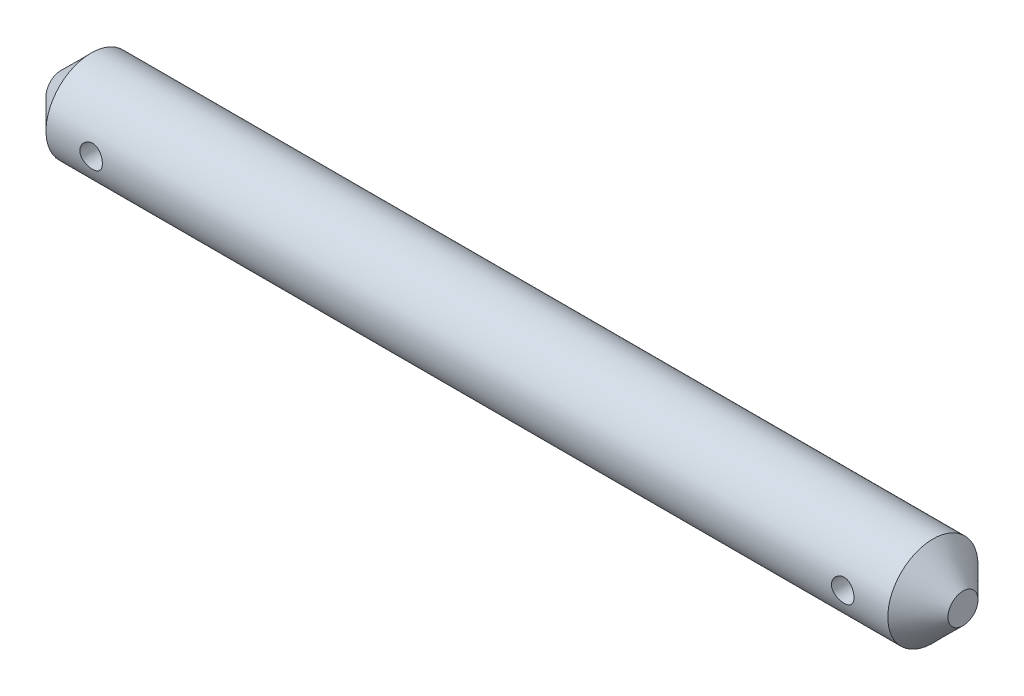
ISO-10303-21;
HEADER;
FILE_DESCRIPTION(('STEP AP214'),'2;1');
FILE_NAME('part.step','',(''),(''),'','','');
FILE_SCHEMA(('AUTOMOTIVE_DESIGN { 1 0 10303 214 1 1 1 1 }'));
ENDSEC;
DATA;
#1=APPLICATION_CONTEXT('core data for automotive mechanical design processes');
#2=APPLICATION_PROTOCOL_DEFINITION('international standard','automotive_design',2000,#1);
#3=PRODUCT_CONTEXT('',#1,'mechanical');
#4=PRODUCT('Part','Part','',(#3));
#5=PRODUCT_RELATED_PRODUCT_CATEGORY('part','',(#4));
#6=PRODUCT_DEFINITION_FORMATION('','',#4);
#7=PRODUCT_DEFINITION_CONTEXT('part definition',#1,'design');
#8=PRODUCT_DEFINITION('design','',#6,#7);
#9=PRODUCT_DEFINITION_SHAPE('','',#8);
#10=(LENGTH_UNIT() NAMED_UNIT(*) SI_UNIT(.MILLI.,.METRE.));
#11=(NAMED_UNIT(*) PLANE_ANGLE_UNIT() SI_UNIT($,.RADIAN.));
#12=(NAMED_UNIT(*) SI_UNIT($,.STERADIAN.) SOLID_ANGLE_UNIT());
#13=UNCERTAINTY_MEASURE_WITH_UNIT(LENGTH_MEASURE(1.E-05),#10,'distance_accuracy_value','');
#14=(GEOMETRIC_REPRESENTATION_CONTEXT(3) GLOBAL_UNCERTAINTY_ASSIGNED_CONTEXT((#13)) GLOBAL_UNIT_ASSIGNED_CONTEXT((#10,
#11,#12)) REPRESENTATION_CONTEXT('',''));
#15=CARTESIAN_POINT('',(0.,0.,0.));
#16=DIRECTION('',(0.,0.,1.));
#17=DIRECTION('',(1.,0.,0.));
#18=AXIS2_PLACEMENT_3D('',#15,#16,#17);
#19=CARTESIAN_POINT('',(60.,0.,0.));
#20=DIRECTION('',(-1.,0.,0.));
#21=DIRECTION('',(0.,0.,1.));
#22=AXIS2_PLACEMENT_3D('',#19,#20,#21);
#23=CYLINDRICAL_SURFACE('',#22,3.);
#24=CARTESIAN_POINT('',(5.75,0.,-3.));
#25=CARTESIAN_POINT('',(5.74999883713092,0.0414380443348655,-2.99999929934006));
#26=CARTESIAN_POINT('',(5.74655422461311,0.0828890789153816,-2.99913289065914));
#27=CARTESIAN_POINT('',(5.7328874243465,0.164603161885266,-2.99576056914946));
#28=CARTESIAN_POINT('',(5.72266139523107,0.204865523435369,-2.99325372709984));
#29=CARTESIAN_POINT('',(5.69578037326895,0.283010436091288,-2.9868781316602));
#30=CARTESIAN_POINT('',(5.67913310064236,0.320895781715001,-2.98301101421043));
#31=CARTESIAN_POINT('',(5.63990930497758,0.393336065952213,-2.97432671903796));
#32=CARTESIAN_POINT('',(5.61733258194053,0.427890892174379,-2.96950950927025));
#33=CARTESIAN_POINT('',(5.56639960517289,0.493400963650459,-2.95933706795901));
#34=CARTESIAN_POINT('',(5.53794421252041,0.524277845030535,-2.95397353574266));
#35=CARTESIAN_POINT('',(5.47627389754554,0.580874463601651,-2.94336810058765));
#36=CARTESIAN_POINT('',(5.44305843852675,0.606593618474567,-2.93812621144174));
#37=CARTESIAN_POINT('',(5.37220238663128,0.652513271399515,-2.92827387849855));
#38=CARTESIAN_POINT('',(5.3345033845948,0.672626107962678,-2.92367397235303));
#39=CARTESIAN_POINT('',(5.25612579417082,0.706198454275263,-2.91574747406112));
#40=CARTESIAN_POINT('',(5.21544768333712,0.719659027719666,-2.91242067836394));
#41=CARTESIAN_POINT('',(5.13312825089876,0.739277418402144,-2.90750238358775));
#42=CARTESIAN_POINT('',(5.0915225519751,0.745576134166668,-2.90587745537713));
#43=CARTESIAN_POINT('',(5.00781571549301,0.751130887533925,-2.9044468126887));
#44=CARTESIAN_POINT('',(4.9657146596507,0.750388070908988,-2.90464080224322));
#45=CARTESIAN_POINT('',(4.88329209612776,0.74199326231964,-2.90679602748309));
#46=CARTESIAN_POINT('',(4.84295218926745,0.734509170095259,-2.9087143150094));
#47=CARTESIAN_POINT('',(4.76411947454435,0.713112093451553,-2.91403354838242));
#48=CARTESIAN_POINT('',(4.72562679848551,0.699198651034711,-2.91743459985348));
#49=CARTESIAN_POINT('',(4.65113099187397,0.665194738968577,-2.92537556952093));
#50=CARTESIAN_POINT('',(4.61515691410522,0.645043333616455,-2.9299266373471));
#51=CARTESIAN_POINT('',(4.54704064512158,0.599178138007476,-2.93964855423193));
#52=CARTESIAN_POINT('',(4.51489912596637,0.573463374404419,-2.94481951167368));
#53=CARTESIAN_POINT('',(4.4543981921528,0.516331712340608,-2.9553794026989));
#54=CARTESIAN_POINT('',(4.42617275496932,0.484773129082929,-2.96077034738986));
#55=CARTESIAN_POINT('',(4.37538937876805,0.417305958751849,-2.97102982789393));
#56=CARTESIAN_POINT('',(4.35283161286822,0.381397238853971,-2.97589834774708));
#57=CARTESIAN_POINT('',(4.31397470688781,0.306057944340695,-2.98458866047091));
#58=CARTESIAN_POINT('',(4.29769732987279,0.266615696604311,-2.98840680063863));
#59=CARTESIAN_POINT('',(4.27204134714521,0.185438004071441,-2.99453958495709));
#60=CARTESIAN_POINT('',(4.26266142179093,0.143702999575242,-2.9968545166964));
#61=CARTESIAN_POINT('',(4.25127121722058,0.0602699851950132,-2.99967749635687));
#62=CARTESIAN_POINT('',(4.24907848696235,0.0185983599941046,-3.00023026754139));
#63=CARTESIAN_POINT('',(4.25162450102774,-0.0645164374007543,-2.99959402407225));
#64=CARTESIAN_POINT('',(4.25636262139957,-0.105959629822298,-2.99840516620923));
#65=CARTESIAN_POINT('',(4.27248545419569,-0.186807134388246,-2.99444790563678));
#66=CARTESIAN_POINT('',(4.28377063173849,-0.226232559484377,-2.99170317092906));
#67=CARTESIAN_POINT('',(4.31255354201422,-0.302628646226256,-2.98494353317067));
#68=CARTESIAN_POINT('',(4.33005190215659,-0.339599059516317,-2.98092850184946));
#69=CARTESIAN_POINT('',(4.37111806443736,-0.410761567214923,-2.97196653963155));
#70=CARTESIAN_POINT('',(4.39478805619838,-0.444892720917915,-2.96700433683466));
#71=CARTESIAN_POINT('',(4.44739495439849,-0.508763306821623,-2.9567225459371));
#72=CARTESIAN_POINT('',(4.47633276980845,-0.538501979486504,-2.95140289625852));
#73=CARTESIAN_POINT('',(4.53950098042223,-0.593495284036365,-2.94084478480386));
#74=CARTESIAN_POINT('',(4.57384385150121,-0.618621933811015,-2.9356115209364));
#75=CARTESIAN_POINT('',(4.64636631723286,-0.662755379506348,-2.92596439188619));
#76=CARTESIAN_POINT('',(4.68454574147988,-0.681762447078968,-2.92155049033513));
#77=CARTESIAN_POINT('',(4.76345286120654,-0.712975710304645,-2.91409047367332));
#78=CARTESIAN_POINT('',(4.804163814172,-0.725222198327032,-2.91103627645953));
#79=CARTESIAN_POINT('',(4.88715481894455,-0.742672829976889,-2.90663372045092));
#80=CARTESIAN_POINT('',(4.92943452551625,-0.747878513739328,-2.90528498859968));
#81=CARTESIAN_POINT('',(5.0130605119276,-0.751019295166997,-2.90447450601978));
#82=CARTESIAN_POINT('',(5.05439871756237,-0.749158948890058,-2.90495966364132));
#83=CARTESIAN_POINT('',(5.13615194433399,-0.738688639156433,-2.90763954503921));
#84=CARTESIAN_POINT('',(5.17656698400683,-0.730078811343384,-2.90983423445928));
#85=CARTESIAN_POINT('',(5.2551042295327,-0.706465659721396,-2.91565630341361));
#86=CARTESIAN_POINT('',(5.2932386526201,-0.691500702340187,-2.91927507618155));
#87=CARTESIAN_POINT('',(5.36648269135685,-0.655632456802535,-2.92753877862414));
#88=CARTESIAN_POINT('',(5.40159188659346,-0.634728345017094,-2.93218385060386));
#89=CARTESIAN_POINT('',(5.46877731450101,-0.586933874318567,-2.94212817131756));
#90=CARTESIAN_POINT('',(5.50075053671198,-0.559901581456126,-2.94744132415878));
#91=CARTESIAN_POINT('',(5.5597735223977,-0.500894685594867,-2.95804013623143));
#92=CARTESIAN_POINT('',(5.58682211505648,-0.468918910630572,-2.9633257886353));
#93=CARTESIAN_POINT('',(5.6357056542823,-0.400233793351294,-2.97338827823831));
#94=CARTESIAN_POINT('',(5.65743730683579,-0.363449211158193,-2.97815416682934));
#95=CARTESIAN_POINT('',(5.69437373147026,-0.286633029755238,-2.98652462487559));
#96=CARTESIAN_POINT('',(5.70958318032427,-0.246603781718369,-2.99013002599891));
#97=CARTESIAN_POINT('',(5.73078591516483,-0.172205126621735,-2.99524029782771));
#98=CARTESIAN_POINT('',(5.73797562152672,-0.138190085454034,-2.99701292526345));
#99=CARTESIAN_POINT('',(5.74758297181097,-0.0694530357681412,-2.99939302615974));
#100=CARTESIAN_POINT('',(5.75000097465265,-0.0347310806213079,-3.00000058725447));
#101=CARTESIAN_POINT('',(5.75,0.,-3.));
#102=B_SPLINE_CURVE_WITH_KNOTS('',3,(#24,#25,#26,#27,#28,#29,#30,#31,#32,#33,#34,#35,#36,#37,
#38,#39,#40,#41,#42,#43,#44,#45,#46,#47,#48,#49,#50,#51,#52,#53,#54,#55,#56,#57,#58,#59,#60,#61,
#62,#63,#64,#65,#66,#67,#68,#69,#70,#71,#72,#73,#74,#75,#76,#77,#78,#79,#80,#81,#82,#83,#84,#85,
#86,#87,#88,#89,#90,#91,#92,#93,#94,#95,#96,#97,#98,#99,#100,#101),.UNSPECIFIED.,.T.,.F.,(4,2,2,
2,2,2,2,2,2,2,2,2,2,2,2,2,2,2,2,2,2,2,2,2,2,2,2,2,2,2,2,2,2,2,2,2,2,2,4),(0.,0.124186856235945,
0.24844411888195,0.372552451143052,0.496664970084664,0.623072177185694,0.749493647900309,
0.877793237729034,1.00607230584684,1.13178147549715,1.25747019056348,1.38011248503509,
1.50276351733019,1.62665263936939,1.75056345418081,1.8780075048451,2.00545544779123,
2.13334114504557,2.26120236844321,2.38579154474638,2.51036950556371,2.63310137257018,
2.75584563661145,2.88076793782676,3.00571181504009,3.13372254602238,3.26172759374754,
3.38896127307018,3.51616711626203,3.63971890199306,3.76326820478017,3.88608200279723,
4.0089128406845,4.13494788204955,4.26101284885208,4.38936092749793,4.51761681910674,
4.62171121471074,4.72579778021519),.UNSPECIFIED.);
#103=CARTESIAN_POINT('',(5.75,0.,-3.));
#104=VERTEX_POINT('',#103);
#105=EDGE_CURVE('E10',#104,#104,#102,.T.);
#106=ORIENTED_EDGE('',*,*,#105,.T.);
#107=EDGE_LOOP('',(#106));
#108=FACE_BOUND('',#107,.T.);
#109=CARTESIAN_POINT('',(5.75,0.,3.));
#110=CARTESIAN_POINT('',(5.74999883713092,-0.0414380443348655,2.99999929934006));
#111=CARTESIAN_POINT('',(5.74655422461311,-0.0828890789153816,2.99913289065914));
#112=CARTESIAN_POINT('',(5.7328874243465,-0.164603161885266,2.99576056914946));
#113=CARTESIAN_POINT('',(5.72266139523107,-0.204865523435369,2.99325372709984));
#114=CARTESIAN_POINT('',(5.69578037326895,-0.283010436091288,2.9868781316602));
#115=CARTESIAN_POINT('',(5.67913310064236,-0.320895781715001,2.98301101421043));
#116=CARTESIAN_POINT('',(5.63990930497758,-0.393336065952213,2.97432671903796));
#117=CARTESIAN_POINT('',(5.61733258194053,-0.427890892174379,2.96950950927025));
#118=CARTESIAN_POINT('',(5.56639960517289,-0.493400963650459,2.95933706795901));
#119=CARTESIAN_POINT('',(5.53794421252041,-0.524277845030535,2.95397353574266));
#120=CARTESIAN_POINT('',(5.47627389754554,-0.580874463601651,2.94336810058765));
#121=CARTESIAN_POINT('',(5.44305843852675,-0.606593618474567,2.93812621144174));
#122=CARTESIAN_POINT('',(5.37220238663128,-0.652513271399515,2.92827387849855));
#123=CARTESIAN_POINT('',(5.3345033845948,-0.672626107962678,2.92367397235303));
#124=CARTESIAN_POINT('',(5.25612579417082,-0.706198454275263,2.91574747406112));
#125=CARTESIAN_POINT('',(5.21544768333712,-0.719659027719666,2.91242067836394));
#126=CARTESIAN_POINT('',(5.13312825089876,-0.739277418402144,2.90750238358775));
#127=CARTESIAN_POINT('',(5.0915225519751,-0.745576134166668,2.90587745537713));
#128=CARTESIAN_POINT('',(5.00781571549301,-0.751130887533925,2.9044468126887));
#129=CARTESIAN_POINT('',(4.9657146596507,-0.750388070908988,2.90464080224322));
#130=CARTESIAN_POINT('',(4.88329209612776,-0.74199326231964,2.90679602748309));
#131=CARTESIAN_POINT('',(4.84295218926745,-0.734509170095259,2.9087143150094));
#132=CARTESIAN_POINT('',(4.76411947454435,-0.713112093451553,2.91403354838242));
#133=CARTESIAN_POINT('',(4.72562679848551,-0.699198651034711,2.91743459985348));
#134=CARTESIAN_POINT('',(4.65113099187397,-0.665194738968577,2.92537556952093));
#135=CARTESIAN_POINT('',(4.61515691410522,-0.645043333616455,2.9299266373471));
#136=CARTESIAN_POINT('',(4.54704064512158,-0.599178138007476,2.93964855423193));
#137=CARTESIAN_POINT('',(4.51489912596637,-0.573463374404419,2.94481951167368));
#138=CARTESIAN_POINT('',(4.4543981921528,-0.516331712340608,2.9553794026989));
#139=CARTESIAN_POINT('',(4.42617275496932,-0.484773129082929,2.96077034738986));
#140=CARTESIAN_POINT('',(4.37538937876805,-0.417305958751849,2.97102982789393));
#141=CARTESIAN_POINT('',(4.35283161286822,-0.381397238853971,2.97589834774708));
#142=CARTESIAN_POINT('',(4.31397470688781,-0.306057944340695,2.98458866047091));
#143=CARTESIAN_POINT('',(4.29769732987279,-0.266615696604311,2.98840680063863));
#144=CARTESIAN_POINT('',(4.27204134714521,-0.185438004071441,2.99453958495709));
#145=CARTESIAN_POINT('',(4.26266142179093,-0.143702999575242,2.9968545166964));
#146=CARTESIAN_POINT('',(4.25127121722058,-0.0602699851950132,2.99967749635687));
#147=CARTESIAN_POINT('',(4.24907848696235,-0.0185983599941046,3.00023026754139));
#148=CARTESIAN_POINT('',(4.25162450102774,0.0645164374007543,2.99959402407225));
#149=CARTESIAN_POINT('',(4.25636262139957,0.105959629822298,2.99840516620923));
#150=CARTESIAN_POINT('',(4.27248545419569,0.186807134388246,2.99444790563678));
#151=CARTESIAN_POINT('',(4.28377063173849,0.226232559484377,2.99170317092906));
#152=CARTESIAN_POINT('',(4.31255354201422,0.302628646226256,2.98494353317067));
#153=CARTESIAN_POINT('',(4.33005190215659,0.339599059516317,2.98092850184946));
#154=CARTESIAN_POINT('',(4.37111806443736,0.410761567214923,2.97196653963155));
#155=CARTESIAN_POINT('',(4.39478805619838,0.444892720917915,2.96700433683466));
#156=CARTESIAN_POINT('',(4.44739495439849,0.508763306821623,2.9567225459371));
#157=CARTESIAN_POINT('',(4.47633276980845,0.538501979486504,2.95140289625852));
#158=CARTESIAN_POINT('',(4.53950098042223,0.593495284036365,2.94084478480386));
#159=CARTESIAN_POINT('',(4.57384385150121,0.618621933811015,2.9356115209364));
#160=CARTESIAN_POINT('',(4.64636631723286,0.662755379506348,2.92596439188619));
#161=CARTESIAN_POINT('',(4.68454574147988,0.681762447078968,2.92155049033513));
#162=CARTESIAN_POINT('',(4.76345286120654,0.712975710304645,2.91409047367332));
#163=CARTESIAN_POINT('',(4.804163814172,0.725222198327032,2.91103627645953));
#164=CARTESIAN_POINT('',(4.88715481894455,0.742672829976889,2.90663372045092));
#165=CARTESIAN_POINT('',(4.92943452551625,0.747878513739328,2.90528498859968));
#166=CARTESIAN_POINT('',(5.0130605119276,0.751019295166997,2.90447450601978));
#167=CARTESIAN_POINT('',(5.05439871756237,0.749158948890058,2.90495966364132));
#168=CARTESIAN_POINT('',(5.13615194433399,0.738688639156433,2.90763954503921));
#169=CARTESIAN_POINT('',(5.17656698400683,0.730078811343384,2.90983423445928));
#170=CARTESIAN_POINT('',(5.2551042295327,0.706465659721396,2.91565630341361));
#171=CARTESIAN_POINT('',(5.2932386526201,0.691500702340187,2.91927507618155));
#172=CARTESIAN_POINT('',(5.36648269135685,0.655632456802535,2.92753877862414));
#173=CARTESIAN_POINT('',(5.40159188659346,0.634728345017094,2.93218385060386));
#174=CARTESIAN_POINT('',(5.46877731450101,0.586933874318567,2.94212817131756));
#175=CARTESIAN_POINT('',(5.50075053671198,0.559901581456126,2.94744132415878));
#176=CARTESIAN_POINT('',(5.5597735223977,0.500894685594867,2.95804013623143));
#177=CARTESIAN_POINT('',(5.58682211505648,0.468918910630572,2.9633257886353));
#178=CARTESIAN_POINT('',(5.6357056542823,0.400233793351294,2.97338827823831));
#179=CARTESIAN_POINT('',(5.65743730683579,0.363449211158193,2.97815416682934));
#180=CARTESIAN_POINT('',(5.69437373147026,0.286633029755238,2.98652462487559));
#181=CARTESIAN_POINT('',(5.70958318032427,0.246603781718369,2.99013002599891));
#182=CARTESIAN_POINT('',(5.73078591516483,0.172205126621735,2.99524029782771));
#183=CARTESIAN_POINT('',(5.73797562152672,0.138190085454034,2.99701292526345));
#184=CARTESIAN_POINT('',(5.74758297181097,0.0694530357681412,2.99939302615974));
#185=CARTESIAN_POINT('',(5.75000097465265,0.0347310806213079,3.00000058725447));
#186=CARTESIAN_POINT('',(5.75,0.,3.));
#187=B_SPLINE_CURVE_WITH_KNOTS('',3,(#109,#110,#111,#112,#113,#114,#115,#116,#117,#118,#119,
#120,#121,#122,#123,#124,#125,#126,#127,#128,#129,#130,#131,#132,#133,#134,#135,#136,#137,#138,
#139,#140,#141,#142,#143,#144,#145,#146,#147,#148,#149,#150,#151,#152,#153,#154,#155,#156,#157,
#158,#159,#160,#161,#162,#163,#164,#165,#166,#167,#168,#169,#170,#171,#172,#173,#174,#175,#176,
#177,#178,#179,#180,#181,#182,#183,#184,#185,#186),.UNSPECIFIED.,.T.,.F.,(4,2,2,2,2,2,2,2,2,2,2,
2,2,2,2,2,2,2,2,2,2,2,2,2,2,2,2,2,2,2,2,2,2,2,2,2,2,2,4),(0.,0.124186856235945,0.24844411888195,
0.372552451143052,0.496664970084664,0.623072177185694,0.749493647900309,0.877793237729034,
1.00607230584684,1.13178147549715,1.25747019056348,1.38011248503509,1.50276351733019,
1.62665263936939,1.75056345418081,1.8780075048451,2.00545544779123,2.13334114504557,
2.26120236844321,2.38579154474638,2.51036950556371,2.63310137257018,2.75584563661145,
2.88076793782676,3.00571181504009,3.13372254602238,3.26172759374754,3.38896127307018,
3.51616711626203,3.63971890199306,3.76326820478017,3.88608200279723,4.0089128406845,
4.13494788204955,4.26101284885208,4.38936092749793,4.51761681910674,4.62171121471074,
4.72579778021519),.UNSPECIFIED.);
#188=CARTESIAN_POINT('',(5.75,0.,3.));
#189=VERTEX_POINT('',#188);
#190=EDGE_CURVE('E52',#189,#189,#187,.T.);
#191=ORIENTED_EDGE('',*,*,#190,.T.);
#192=EDGE_LOOP('',(#191));
#193=FACE_BOUND('',#192,.T.);
#194=CARTESIAN_POINT('',(55.75,0.,-3.));
#195=CARTESIAN_POINT('',(55.7499988371309,0.0414380443348653,-2.99999929934006));
#196=CARTESIAN_POINT('',(55.7465542246131,0.0828890789153812,-2.99913289065914));
#197=CARTESIAN_POINT('',(55.7328874243465,0.164603161885266,-2.99576056914946));
#198=CARTESIAN_POINT('',(55.7226613952311,0.20486552343537,-2.99325372709984));
#199=CARTESIAN_POINT('',(55.695780373269,0.283010436091289,-2.9868781316602));
#200=CARTESIAN_POINT('',(55.6791331006424,0.320895781715002,-2.98301101421043));
#201=CARTESIAN_POINT('',(55.6399093049776,0.393336065952213,-2.97432671903796));
#202=CARTESIAN_POINT('',(55.6173325819405,0.427890892174379,-2.96950950927025));
#203=CARTESIAN_POINT('',(55.5663996051729,0.493400963650459,-2.95933706795901));
#204=CARTESIAN_POINT('',(55.5379442125204,0.524277845030534,-2.95397353574266));
#205=CARTESIAN_POINT('',(55.4762738975455,0.58087446360165,-2.94336810058765));
#206=CARTESIAN_POINT('',(55.4430584385268,0.606593618474565,-2.93812621144174));
#207=CARTESIAN_POINT('',(55.3722023866313,0.652513271399514,-2.92827387849855));
#208=CARTESIAN_POINT('',(55.3345033845948,0.672626107962676,-2.92367397235302));
#209=CARTESIAN_POINT('',(55.2561257941708,0.706198454275262,-2.91574747406112));
#210=CARTESIAN_POINT('',(55.2154476833371,0.719659027719665,-2.91242067836394));
#211=CARTESIAN_POINT('',(55.1331282508988,0.739277418402144,-2.90750238358775));
#212=CARTESIAN_POINT('',(55.0915225519751,0.745576134166668,-2.90587745537713));
#213=CARTESIAN_POINT('',(55.007815715493,0.751130887533924,-2.9044468126887));
#214=CARTESIAN_POINT('',(54.9657146596507,0.750388070908987,-2.90464080224322));
#215=CARTESIAN_POINT('',(54.8832920961278,0.741993262319639,-2.90679602748309));
#216=CARTESIAN_POINT('',(54.8429521892675,0.734509170095259,-2.9087143150094));
#217=CARTESIAN_POINT('',(54.7641194745444,0.713112093451553,-2.91403354838242));
#218=CARTESIAN_POINT('',(54.7256267984855,0.699198651034711,-2.91743459985348));
#219=CARTESIAN_POINT('',(54.651130991874,0.665194738968578,-2.92537556952093));
#220=CARTESIAN_POINT('',(54.6151569141052,0.645043333616457,-2.9299266373471));
#221=CARTESIAN_POINT('',(54.5470406451216,0.599178138007478,-2.93964855423193));
#222=CARTESIAN_POINT('',(54.5148991259664,0.573463374404418,-2.94481951167368));
#223=CARTESIAN_POINT('',(54.4543981921528,0.516331712340605,-2.95537940269891));
#224=CARTESIAN_POINT('',(54.4261727549693,0.484773129082927,-2.96077034738986));
#225=CARTESIAN_POINT('',(54.375389378768,0.417305958751849,-2.97102982789393));
#226=CARTESIAN_POINT('',(54.3528316128682,0.381397238853972,-2.97589834774708));
#227=CARTESIAN_POINT('',(54.3139747068878,0.306057944340696,-2.98458866047091));
#228=CARTESIAN_POINT('',(54.2976973298728,0.266615696604311,-2.98840680063863));
#229=CARTESIAN_POINT('',(54.2720413471452,0.185438004071439,-2.99453958495709));
#230=CARTESIAN_POINT('',(54.2626614217909,0.143702999575239,-2.9968545166964));
#231=CARTESIAN_POINT('',(54.2512712172206,0.06026998519501,-2.99967749635687));
#232=CARTESIAN_POINT('',(54.2490784869624,0.0185983599941017,-3.00023026754139));
#233=CARTESIAN_POINT('',(54.2516245010277,-0.0645164374007564,-2.99959402407225));
#234=CARTESIAN_POINT('',(54.2563626213996,-0.105959629822299,-2.99840516620923));
#235=CARTESIAN_POINT('',(54.2724854541957,-0.186807134388248,-2.99444790563678));
#236=CARTESIAN_POINT('',(54.2837706317385,-0.22623255948438,-2.99170317092906));
#237=CARTESIAN_POINT('',(54.3125535420142,-0.302628646226259,-2.98494353317067));
#238=CARTESIAN_POINT('',(54.3300519021566,-0.339599059516319,-2.98092850184946));
#239=CARTESIAN_POINT('',(54.3711180644374,-0.410761567214924,-2.97196653963155));
#240=CARTESIAN_POINT('',(54.3947880561984,-0.444892720917914,-2.96700433683466));
#241=CARTESIAN_POINT('',(54.4473949543985,-0.508763306821623,-2.9567225459371));
#242=CARTESIAN_POINT('',(54.4763327698085,-0.538501979486505,-2.95140289625852));
#243=CARTESIAN_POINT('',(54.5395009804222,-0.593495284036366,-2.94084478480385));
#244=CARTESIAN_POINT('',(54.5738438515012,-0.618621933811016,-2.9356115209364));
#245=CARTESIAN_POINT('',(54.6463663172329,-0.662755379506348,-2.92596439188619));
#246=CARTESIAN_POINT('',(54.6845457414799,-0.681762447078968,-2.92155049033513));
#247=CARTESIAN_POINT('',(54.7634528612065,-0.712975710304645,-2.91409047367333));
#248=CARTESIAN_POINT('',(54.804163814172,-0.725222198327031,-2.91103627645953));
#249=CARTESIAN_POINT('',(54.8871548189446,-0.742672829976888,-2.90663372045092));
#250=CARTESIAN_POINT('',(54.9294345255162,-0.747878513739328,-2.90528498859968));
#251=CARTESIAN_POINT('',(55.0130605119276,-0.751019295166996,-2.90447450601978));
#252=CARTESIAN_POINT('',(55.0543987175624,-0.749158948890057,-2.90495966364132));
#253=CARTESIAN_POINT('',(55.136151944334,-0.738688639156432,-2.90763954503921));
#254=CARTESIAN_POINT('',(55.1765669840068,-0.730078811343383,-2.90983423445928));
#255=CARTESIAN_POINT('',(55.2551042295327,-0.706465659721396,-2.91565630341361));
#256=CARTESIAN_POINT('',(55.2932386526201,-0.691500702340186,-2.91927507618155));
#257=CARTESIAN_POINT('',(55.3664826913568,-0.655632456802533,-2.92753877862414));
#258=CARTESIAN_POINT('',(55.4015918865935,-0.634728345017092,-2.93218385060387));
#259=CARTESIAN_POINT('',(55.468777314501,-0.586933874318566,-2.94212817131756));
#260=CARTESIAN_POINT('',(55.500750536712,-0.559901581456126,-2.94744132415878));
#261=CARTESIAN_POINT('',(55.5597735223977,-0.500894685594867,-2.95804013623143));
#262=CARTESIAN_POINT('',(55.5868221150565,-0.468918910630572,-2.9633257886353));
#263=CARTESIAN_POINT('',(55.6357056542823,-0.400233793351293,-2.97338827823831));
#264=CARTESIAN_POINT('',(55.6574373068358,-0.363449211158191,-2.97815416682934));
#265=CARTESIAN_POINT('',(55.6943737314703,-0.286633029755234,-2.98652462487559));
#266=CARTESIAN_POINT('',(55.7095831803243,-0.246603781718366,-2.99013002599891));
#267=CARTESIAN_POINT('',(55.7307859151648,-0.172205126621733,-2.99524029782771));
#268=CARTESIAN_POINT('',(55.7379756215267,-0.138190085454032,-2.99701292526345));
#269=CARTESIAN_POINT('',(55.747582971811,-0.0694530357681404,-2.99939302615974));
#270=CARTESIAN_POINT('',(55.7500009746527,-0.0347310806213075,-3.00000058725447));
#271=CARTESIAN_POINT('',(55.75,0.,-3.));
#272=B_SPLINE_CURVE_WITH_KNOTS('',3,(#194,#195,#196,#197,#198,#199,#200,#201,#202,#203,#204,
#205,#206,#207,#208,#209,#210,#211,#212,#213,#214,#215,#216,#217,#218,#219,#220,#221,#222,#223,
#224,#225,#226,#227,#228,#229,#230,#231,#232,#233,#234,#235,#236,#237,#238,#239,#240,#241,#242,
#243,#244,#245,#246,#247,#248,#249,#250,#251,#252,#253,#254,#255,#256,#257,#258,#259,#260,#261,
#262,#263,#264,#265,#266,#267,#268,#269,#270,#271),.UNSPECIFIED.,.T.,.F.,(4,2,2,2,2,2,2,2,2,2,2,
2,2,2,2,2,2,2,2,2,2,2,2,2,2,2,2,2,2,2,2,2,2,2,2,2,2,2,4),(0.,0.124186856235945,0.24844411888195,
0.372552451143053,0.496664970084663,0.623072177185692,0.749493647900306,0.877793237729032,
1.00607230584684,1.13178147549715,1.25747019056348,1.38011248503509,1.50276351733018,
1.62665263936939,1.75056345418081,1.87800750484509,2.00545544779123,2.13334114504557,
2.26120236844321,2.38579154474638,2.51036950556371,2.63310137257018,2.75584563661145,
2.88076793782675,3.00571181504009,3.13372254602237,3.26172759374753,3.38896127307018,
3.51616711626204,3.63971890199306,3.76326820478017,3.88608200279723,4.0089128406845,
4.13494788204954,4.26101284885208,4.38936092749793,4.51761681910674,4.62171121471074,
4.72579778021519),.UNSPECIFIED.);
#273=CARTESIAN_POINT('',(55.75,0.,-3.));
#274=VERTEX_POINT('',#273);
#275=EDGE_CURVE('E56',#274,#274,#272,.T.);
#276=ORIENTED_EDGE('',*,*,#275,.T.);
#277=EDGE_LOOP('',(#276));
#278=FACE_BOUND('',#277,.T.);
#279=CARTESIAN_POINT('',(55.75,0.,3.));
#280=CARTESIAN_POINT('',(55.7499988371309,-0.0414380443348653,2.99999929934006));
#281=CARTESIAN_POINT('',(55.7465542246131,-0.0828890789153812,2.99913289065914));
#282=CARTESIAN_POINT('',(55.7328874243465,-0.164603161885266,2.99576056914946));
#283=CARTESIAN_POINT('',(55.7226613952311,-0.20486552343537,2.99325372709984));
#284=CARTESIAN_POINT('',(55.695780373269,-0.283010436091289,2.9868781316602));
#285=CARTESIAN_POINT('',(55.6791331006424,-0.320895781715002,2.98301101421043));
#286=CARTESIAN_POINT('',(55.6399093049776,-0.393336065952213,2.97432671903796));
#287=CARTESIAN_POINT('',(55.6173325819405,-0.427890892174379,2.96950950927025));
#288=CARTESIAN_POINT('',(55.5663996051729,-0.493400963650459,2.95933706795901));
#289=CARTESIAN_POINT('',(55.5379442125204,-0.524277845030534,2.95397353574266));
#290=CARTESIAN_POINT('',(55.4762738975455,-0.58087446360165,2.94336810058765));
#291=CARTESIAN_POINT('',(55.4430584385268,-0.606593618474565,2.93812621144174));
#292=CARTESIAN_POINT('',(55.3722023866313,-0.652513271399514,2.92827387849855));
#293=CARTESIAN_POINT('',(55.3345033845948,-0.672626107962676,2.92367397235302));
#294=CARTESIAN_POINT('',(55.2561257941708,-0.706198454275262,2.91574747406112));
#295=CARTESIAN_POINT('',(55.2154476833371,-0.719659027719665,2.91242067836394));
#296=CARTESIAN_POINT('',(55.1331282508988,-0.739277418402144,2.90750238358775));
#297=CARTESIAN_POINT('',(55.0915225519751,-0.745576134166668,2.90587745537713));
#298=CARTESIAN_POINT('',(55.007815715493,-0.751130887533924,2.9044468126887));
#299=CARTESIAN_POINT('',(54.9657146596507,-0.750388070908987,2.90464080224322));
#300=CARTESIAN_POINT('',(54.8832920961278,-0.741993262319639,2.90679602748309));
#301=CARTESIAN_POINT('',(54.8429521892675,-0.734509170095259,2.9087143150094));
#302=CARTESIAN_POINT('',(54.7641194745444,-0.713112093451553,2.91403354838242));
#303=CARTESIAN_POINT('',(54.7256267984855,-0.699198651034711,2.91743459985348));
#304=CARTESIAN_POINT('',(54.651130991874,-0.665194738968578,2.92537556952093));
#305=CARTESIAN_POINT('',(54.6151569141052,-0.645043333616457,2.9299266373471));
#306=CARTESIAN_POINT('',(54.5470406451216,-0.599178138007478,2.93964855423193));
#307=CARTESIAN_POINT('',(54.5148991259664,-0.573463374404418,2.94481951167368));
#308=CARTESIAN_POINT('',(54.4543981921528,-0.516331712340605,2.95537940269891));
#309=CARTESIAN_POINT('',(54.4261727549693,-0.484773129082927,2.96077034738986));
#310=CARTESIAN_POINT('',(54.375389378768,-0.417305958751849,2.97102982789393));
#311=CARTESIAN_POINT('',(54.3528316128682,-0.381397238853972,2.97589834774708));
#312=CARTESIAN_POINT('',(54.3139747068878,-0.306057944340696,2.98458866047091));
#313=CARTESIAN_POINT('',(54.2976973298728,-0.266615696604311,2.98840680063863));
#314=CARTESIAN_POINT('',(54.2720413471452,-0.185438004071439,2.99453958495709));
#315=CARTESIAN_POINT('',(54.2626614217909,-0.143702999575239,2.9968545166964));
#316=CARTESIAN_POINT('',(54.2512712172206,-0.06026998519501,2.99967749635687));
#317=CARTESIAN_POINT('',(54.2490784869624,-0.0185983599941017,3.00023026754139));
#318=CARTESIAN_POINT('',(54.2516245010277,0.0645164374007564,2.99959402407225));
#319=CARTESIAN_POINT('',(54.2563626213996,0.105959629822299,2.99840516620923));
#320=CARTESIAN_POINT('',(54.2724854541957,0.186807134388248,2.99444790563678));
#321=CARTESIAN_POINT('',(54.2837706317385,0.22623255948438,2.99170317092906));
#322=CARTESIAN_POINT('',(54.3125535420142,0.302628646226259,2.98494353317067));
#323=CARTESIAN_POINT('',(54.3300519021566,0.339599059516319,2.98092850184946));
#324=CARTESIAN_POINT('',(54.3711180644374,0.410761567214924,2.97196653963155));
#325=CARTESIAN_POINT('',(54.3947880561984,0.444892720917914,2.96700433683466));
#326=CARTESIAN_POINT('',(54.4473949543985,0.508763306821623,2.9567225459371));
#327=CARTESIAN_POINT('',(54.4763327698085,0.538501979486505,2.95140289625852));
#328=CARTESIAN_POINT('',(54.5395009804222,0.593495284036366,2.94084478480385));
#329=CARTESIAN_POINT('',(54.5738438515012,0.618621933811016,2.9356115209364));
#330=CARTESIAN_POINT('',(54.6463663172329,0.662755379506348,2.92596439188619));
#331=CARTESIAN_POINT('',(54.6845457414799,0.681762447078968,2.92155049033513));
#332=CARTESIAN_POINT('',(54.7634528612065,0.712975710304645,2.91409047367333));
#333=CARTESIAN_POINT('',(54.804163814172,0.725222198327031,2.91103627645953));
#334=CARTESIAN_POINT('',(54.8871548189446,0.742672829976888,2.90663372045092));
#335=CARTESIAN_POINT('',(54.9294345255162,0.747878513739328,2.90528498859968));
#336=CARTESIAN_POINT('',(55.0130605119276,0.751019295166996,2.90447450601978));
#337=CARTESIAN_POINT('',(55.0543987175624,0.749158948890057,2.90495966364132));
#338=CARTESIAN_POINT('',(55.136151944334,0.738688639156432,2.90763954503921));
#339=CARTESIAN_POINT('',(55.1765669840068,0.730078811343383,2.90983423445928));
#340=CARTESIAN_POINT('',(55.2551042295327,0.706465659721396,2.91565630341361));
#341=CARTESIAN_POINT('',(55.2932386526201,0.691500702340186,2.91927507618155));
#342=CARTESIAN_POINT('',(55.3664826913568,0.655632456802533,2.92753877862414));
#343=CARTESIAN_POINT('',(55.4015918865935,0.634728345017092,2.93218385060387));
#344=CARTESIAN_POINT('',(55.468777314501,0.586933874318566,2.94212817131756));
#345=CARTESIAN_POINT('',(55.500750536712,0.559901581456126,2.94744132415878));
#346=CARTESIAN_POINT('',(55.5597735223977,0.500894685594867,2.95804013623143));
#347=CARTESIAN_POINT('',(55.5868221150565,0.468918910630572,2.9633257886353));
#348=CARTESIAN_POINT('',(55.6357056542823,0.400233793351293,2.97338827823831));
#349=CARTESIAN_POINT('',(55.6574373068358,0.363449211158191,2.97815416682934));
#350=CARTESIAN_POINT('',(55.6943737314703,0.286633029755234,2.98652462487559));
#351=CARTESIAN_POINT('',(55.7095831803243,0.246603781718366,2.99013002599891));
#352=CARTESIAN_POINT('',(55.7307859151648,0.172205126621733,2.99524029782771));
#353=CARTESIAN_POINT('',(55.7379756215267,0.138190085454032,2.99701292526345));
#354=CARTESIAN_POINT('',(55.747582971811,0.0694530357681404,2.99939302615974));
#355=CARTESIAN_POINT('',(55.7500009746527,0.0347310806213075,3.00000058725447));
#356=CARTESIAN_POINT('',(55.75,0.,3.));
#357=B_SPLINE_CURVE_WITH_KNOTS('',3,(#279,#280,#281,#282,#283,#284,#285,#286,#287,#288,#289,
#290,#291,#292,#293,#294,#295,#296,#297,#298,#299,#300,#301,#302,#303,#304,#305,#306,#307,#308,
#309,#310,#311,#312,#313,#314,#315,#316,#317,#318,#319,#320,#321,#322,#323,#324,#325,#326,#327,
#328,#329,#330,#331,#332,#333,#334,#335,#336,#337,#338,#339,#340,#341,#342,#343,#344,#345,#346,
#347,#348,#349,#350,#351,#352,#353,#354,#355,#356),.UNSPECIFIED.,.T.,.F.,(4,2,2,2,2,2,2,2,2,2,2,
2,2,2,2,2,2,2,2,2,2,2,2,2,2,2,2,2,2,2,2,2,2,2,2,2,2,2,4),(0.,0.124186856235945,0.24844411888195,
0.372552451143053,0.496664970084663,0.623072177185692,0.749493647900306,0.877793237729032,
1.00607230584684,1.13178147549715,1.25747019056348,1.38011248503509,1.50276351733018,
1.62665263936939,1.75056345418081,1.87800750484509,2.00545544779123,2.13334114504557,
2.26120236844321,2.38579154474638,2.51036950556371,2.63310137257018,2.75584563661145,
2.88076793782675,3.00571181504009,3.13372254602237,3.26172759374753,3.38896127307018,
3.51616711626204,3.63971890199306,3.76326820478017,3.88608200279723,4.0089128406845,
4.13494788204954,4.26101284885208,4.38936092749793,4.51761681910674,4.62171121471074,
4.72579778021519),.UNSPECIFIED.);
#358=CARTESIAN_POINT('',(55.75,0.,3.));
#359=VERTEX_POINT('',#358);
#360=EDGE_CURVE('E60',#359,#359,#357,.T.);
#361=ORIENTED_EDGE('',*,*,#360,.T.);
#362=EDGE_LOOP('',(#361));
#363=FACE_BOUND('',#362,.T.);
#364=CARTESIAN_POINT('',(2.00000000000001,0.,0.));
#365=DIRECTION('',(1.,0.,0.));
#366=DIRECTION('',(0.,0.,-1.));
#367=AXIS2_PLACEMENT_3D('',#364,#365,#366);
#368=CIRCLE('',#367,3.);
#369=CARTESIAN_POINT('',(2.00000000000001,0.,-3.));
#370=VERTEX_POINT('',#369);
#371=EDGE_CURVE('E95',#370,#370,#368,.T.);
#372=ORIENTED_EDGE('',*,*,#371,.T.);
#373=EDGE_LOOP('',(#372));
#374=FACE_BOUND('',#373,.T.);
#375=CARTESIAN_POINT('',(58.,0.,0.));
#376=DIRECTION('',(1.,0.,0.));
#377=DIRECTION('',(0.,0.,-1.));
#378=AXIS2_PLACEMENT_3D('',#375,#376,#377);
#379=CIRCLE('',#378,3.);
#380=CARTESIAN_POINT('',(58.,0.,-3.));
#381=VERTEX_POINT('',#380);
#382=EDGE_CURVE('E98',#381,#381,#379,.F.);
#383=ORIENTED_EDGE('',*,*,#382,.T.);
#384=EDGE_LOOP('',(#383));
#385=FACE_BOUND('',#384,.T.);
#386=ADVANCED_FACE('F39',(#108,#193,#278,#363,#374,#385),#23,.T.);
#387=CARTESIAN_POINT('',(60.,0.,0.));
#388=DIRECTION('',(1.,0.,0.));
#389=DIRECTION('',(0.,0.,-1.));
#390=AXIS2_PLACEMENT_3D('',#387,#388,#389);
#391=PLANE('',#390);
#392=CARTESIAN_POINT('',(60.,0.,0.));
#393=DIRECTION('',(1.,0.,0.));
#394=DIRECTION('',(0.,0.,-1.));
#395=AXIS2_PLACEMENT_3D('',#392,#393,#394);
#396=CIRCLE('',#395,1.00000000000001);
#397=CARTESIAN_POINT('',(60.,0.,-1.00000000000001));
#398=VERTEX_POINT('',#397);
#399=EDGE_CURVE('E89',#398,#398,#396,.T.);
#400=ORIENTED_EDGE('',*,*,#399,.T.);
#401=EDGE_LOOP('',(#400));
#402=FACE_BOUND('',#401,.T.);
#403=ADVANCED_FACE('F82',(#402),#391,.T.);
#404=CARTESIAN_POINT('',(0.,0.,0.));
#405=DIRECTION('',(1.,0.,0.));
#406=DIRECTION('',(0.,0.,-1.));
#407=AXIS2_PLACEMENT_3D('',#404,#405,#406);
#408=PLANE('',#407);
#409=CARTESIAN_POINT('',(0.,0.,0.));
#410=DIRECTION('',(1.,0.,0.));
#411=DIRECTION('',(0.,0.,-1.));
#412=AXIS2_PLACEMENT_3D('',#409,#410,#411);
#413=CIRCLE('',#412,0.99999999999998);
#414=CARTESIAN_POINT('',(0.,0.,-0.99999999999998));
#415=VERTEX_POINT('',#414);
#416=EDGE_CURVE('E92',#415,#415,#413,.F.);
#417=ORIENTED_EDGE('',*,*,#416,.T.);
#418=EDGE_LOOP('',(#417));
#419=FACE_BOUND('',#418,.T.);
#420=ADVANCED_FACE('F109',(#419),#408,.F.);
#421=CARTESIAN_POINT('',(2.00000000000001,0.,0.));
#422=DIRECTION('',(1.,0.,0.));
#423=DIRECTION('',(0.,0.,-1.));
#424=AXIS2_PLACEMENT_3D('',#421,#422,#423);
#425=CONICAL_SURFACE('',#424,3.,0.785398163397451);
#426=ORIENTED_EDGE('',*,*,#416,.F.);
#427=EDGE_LOOP('',(#426));
#428=FACE_BOUND('',#427,.T.);
#429=ORIENTED_EDGE('',*,*,#371,.F.);
#430=EDGE_LOOP('',(#429));
#431=FACE_BOUND('',#430,.T.);
#432=ADVANCED_FACE('F105',(#428,#431),#425,.T.);
#433=CARTESIAN_POINT('',(60.,0.,0.));
#434=DIRECTION('',(-1.,0.,0.));
#435=DIRECTION('',(0.,0.,1.));
#436=AXIS2_PLACEMENT_3D('',#433,#434,#435);
#437=CONICAL_SURFACE('',#436,1.00000000000001,0.785398163397446);
#438=ORIENTED_EDGE('',*,*,#382,.F.);
#439=EDGE_LOOP('',(#438));
#440=FACE_BOUND('',#439,.T.);
#441=ORIENTED_EDGE('',*,*,#399,.F.);
#442=EDGE_LOOP('',(#441));
#443=FACE_BOUND('',#442,.T.);
#444=ADVANCED_FACE('F42',(#440,#443),#437,.T.);
#445=CARTESIAN_POINT('',(55.,0.,-3.));
#446=DIRECTION('',(0.,0.,1.));
#447=DIRECTION('',(1.,0.,0.));
#448=AXIS2_PLACEMENT_3D('',#445,#446,#447);
#449=CYLINDRICAL_SURFACE('',#448,0.749999999999999);
#450=ORIENTED_EDGE('',*,*,#360,.F.);
#451=EDGE_LOOP('',(#450));
#452=FACE_BOUND('',#451,.T.);
#453=ORIENTED_EDGE('',*,*,#275,.F.);
#454=EDGE_LOOP('',(#453));
#455=FACE_BOUND('',#454,.T.);
#456=ADVANCED_FACE('F75',(#452,#455),#449,.F.);
#457=CARTESIAN_POINT('',(5.,0.,-3.));
#458=DIRECTION('',(0.,0.,1.));
#459=DIRECTION('',(1.,0.,0.));
#460=AXIS2_PLACEMENT_3D('',#457,#458,#459);
#461=CYLINDRICAL_SURFACE('',#460,0.749999999999999);
#462=ORIENTED_EDGE('',*,*,#190,.F.);
#463=EDGE_LOOP('',(#462));
#464=FACE_BOUND('',#463,.T.);
#465=ORIENTED_EDGE('',*,*,#105,.F.);
#466=EDGE_LOOP('',(#465));
#467=FACE_BOUND('',#466,.T.);
#468=ADVANCED_FACE('F72',(#464,#467),#461,.F.);
#469=CLOSED_SHELL('',(#386,#403,#420,#432,#444,#456,#468));
#470=MANIFOLD_SOLID_BREP('B2',#469);
#471=ADVANCED_BREP_SHAPE_REPRESENTATION('',(#18,#470),#14);
#472=SHAPE_DEFINITION_REPRESENTATION(#9,#471);
ENDSEC;
END-ISO-10303-21;
